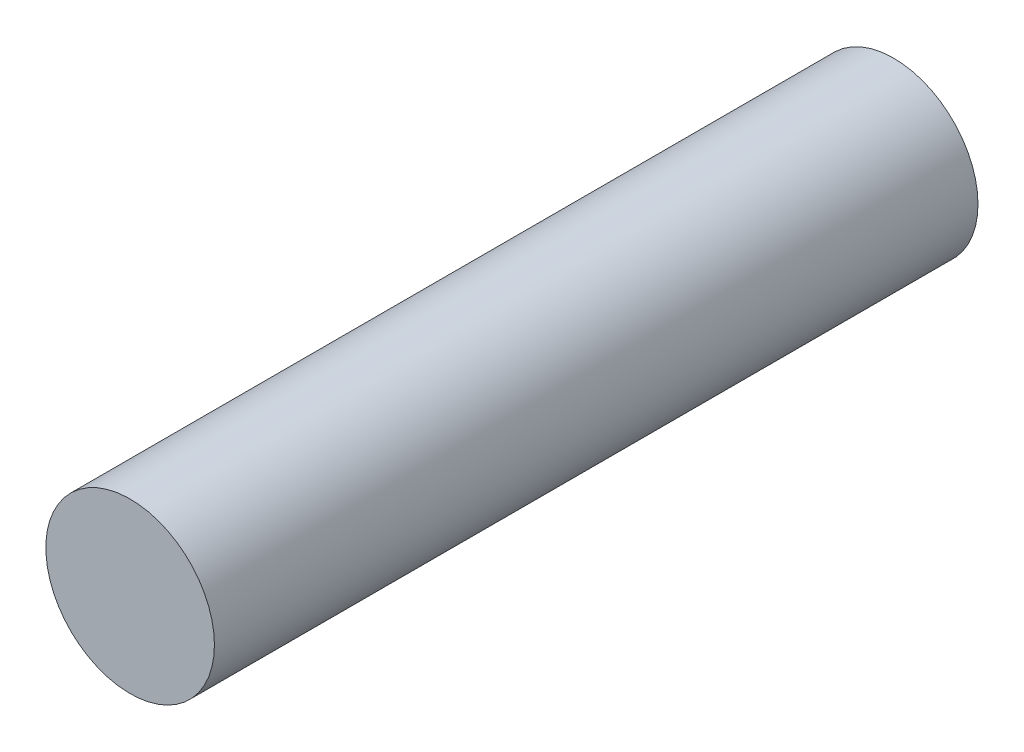
ISO-10303-21;
HEADER;
FILE_DESCRIPTION(('STEP AP214'),'2;1');
FILE_NAME('part.step','',(''),(''),'','','');
FILE_SCHEMA(('AUTOMOTIVE_DESIGN { 1 0 10303 214 1 1 1 1 }'));
ENDSEC;
DATA;
#1=APPLICATION_CONTEXT('core data for automotive mechanical design processes');
#2=APPLICATION_PROTOCOL_DEFINITION('international standard','automotive_design',2000,#1);
#3=PRODUCT_CONTEXT('',#1,'mechanical');
#4=PRODUCT('Part','Part','',(#3));
#5=PRODUCT_RELATED_PRODUCT_CATEGORY('part','',(#4));
#6=PRODUCT_DEFINITION_FORMATION('','',#4);
#7=PRODUCT_DEFINITION_CONTEXT('part definition',#1,'design');
#8=PRODUCT_DEFINITION('design','',#6,#7);
#9=PRODUCT_DEFINITION_SHAPE('','',#8);
#10=(LENGTH_UNIT() NAMED_UNIT(*) SI_UNIT(.MILLI.,.METRE.));
#11=(NAMED_UNIT(*) PLANE_ANGLE_UNIT() SI_UNIT($,.RADIAN.));
#12=(NAMED_UNIT(*) SI_UNIT($,.STERADIAN.) SOLID_ANGLE_UNIT());
#13=UNCERTAINTY_MEASURE_WITH_UNIT(LENGTH_MEASURE(1.E-05),#10,'distance_accuracy_value','');
#14=(GEOMETRIC_REPRESENTATION_CONTEXT(3) GLOBAL_UNCERTAINTY_ASSIGNED_CONTEXT((#13)) GLOBAL_UNIT_ASSIGNED_CONTEXT((#10,
#11,#12)) REPRESENTATION_CONTEXT('',''));
#15=CARTESIAN_POINT('',(0.,0.,0.));
#16=DIRECTION('',(0.,0.,1.));
#17=DIRECTION('',(1.,0.,0.));
#18=AXIS2_PLACEMENT_3D('',#15,#16,#17);
#19=CARTESIAN_POINT('',(0.,0.,177.8));
#20=DIRECTION('',(0.,0.,-1.));
#21=DIRECTION('',(-1.,0.,0.));
#22=AXIS2_PLACEMENT_3D('',#19,#20,#21);
#23=CYLINDRICAL_SURFACE('',#22,39.2557);
#24=CARTESIAN_POINT('',(0.,0.,177.8));
#25=DIRECTION('',(0.,0.,1.));
#26=DIRECTION('',(1.,0.,0.));
#27=AXIS2_PLACEMENT_3D('',#24,#25,#26);
#28=CIRCLE('',#27,39.2557);
#29=CARTESIAN_POINT('',(39.2557,0.,177.8));
#30=VERTEX_POINT('',#29);
#31=EDGE_CURVE('E10',#30,#30,#28,.T.);
#32=ORIENTED_EDGE('',*,*,#31,.F.);
#33=EDGE_LOOP('',(#32));
#34=FACE_BOUND('',#33,.T.);
#35=CARTESIAN_POINT('',(0.,0.,-177.8));
#36=DIRECTION('',(0.,0.,1.));
#37=DIRECTION('',(1.,0.,0.));
#38=AXIS2_PLACEMENT_3D('',#35,#36,#37);
#39=CIRCLE('',#38,39.2557);
#40=CARTESIAN_POINT('',(39.2557,0.,-177.8));
#41=VERTEX_POINT('',#40);
#42=EDGE_CURVE('E52',#41,#41,#39,.T.);
#43=ORIENTED_EDGE('',*,*,#42,.T.);
#44=EDGE_LOOP('',(#43));
#45=FACE_BOUND('',#44,.T.);
#46=ADVANCED_FACE('F49',(#34,#45),#23,.T.);
#47=CARTESIAN_POINT('',(0.,0.,177.8));
#48=DIRECTION('',(0.,0.,1.));
#49=DIRECTION('',(1.,0.,0.));
#50=AXIS2_PLACEMENT_3D('',#47,#48,#49);
#51=PLANE('',#50);
#52=ORIENTED_EDGE('',*,*,#31,.T.);
#53=EDGE_LOOP('',(#52));
#54=FACE_BOUND('',#53,.T.);
#55=ADVANCED_FACE('F66',(#54),#51,.T.);
#56=CARTESIAN_POINT('',(0.,0.,-177.8));
#57=DIRECTION('',(0.,0.,1.));
#58=DIRECTION('',(1.,0.,0.));
#59=AXIS2_PLACEMENT_3D('',#56,#57,#58);
#60=PLANE('',#59);
#61=ORIENTED_EDGE('',*,*,#42,.F.);
#62=EDGE_LOOP('',(#61));
#63=FACE_BOUND('',#62,.T.);
#64=ADVANCED_FACE('F64',(#63),#60,.F.);
#65=CLOSED_SHELL('',(#46,#55,#64));
#66=MANIFOLD_SOLID_BREP('B2',#65);
#67=ADVANCED_BREP_SHAPE_REPRESENTATION('',(#18,#66),#14);
#68=SHAPE_DEFINITION_REPRESENTATION(#9,#67);
ENDSEC;
END-ISO-10303-21;
